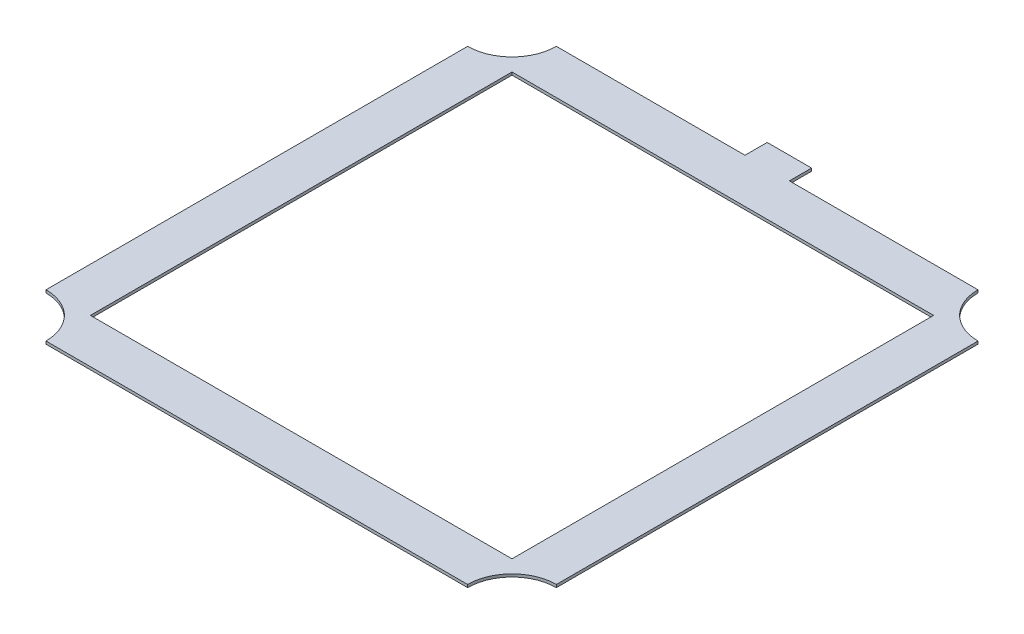
ISO-10303-21;
HEADER;
FILE_DESCRIPTION(('STEP AP214'),'2;1');
FILE_NAME('part.step','',(''),(''),'','','');
FILE_SCHEMA(('AUTOMOTIVE_DESIGN { 1 0 10303 214 1 1 1 1 }'));
ENDSEC;
DATA;
#1=APPLICATION_CONTEXT('core data for automotive mechanical design processes');
#2=APPLICATION_PROTOCOL_DEFINITION('international standard','automotive_design',2000,#1);
#3=PRODUCT_CONTEXT('',#1,'mechanical');
#4=PRODUCT('Part','Part','',(#3));
#5=PRODUCT_RELATED_PRODUCT_CATEGORY('part','',(#4));
#6=PRODUCT_DEFINITION_FORMATION('','',#4);
#7=PRODUCT_DEFINITION_CONTEXT('part definition',#1,'design');
#8=PRODUCT_DEFINITION('design','',#6,#7);
#9=PRODUCT_DEFINITION_SHAPE('','',#8);
#10=(LENGTH_UNIT() NAMED_UNIT(*) SI_UNIT(.MILLI.,.METRE.));
#11=(NAMED_UNIT(*) PLANE_ANGLE_UNIT() SI_UNIT($,.RADIAN.));
#12=(NAMED_UNIT(*) SI_UNIT($,.STERADIAN.) SOLID_ANGLE_UNIT());
#13=UNCERTAINTY_MEASURE_WITH_UNIT(LENGTH_MEASURE(1.E-05),#10,'distance_accuracy_value','');
#14=(GEOMETRIC_REPRESENTATION_CONTEXT(3) GLOBAL_UNCERTAINTY_ASSIGNED_CONTEXT((#13)) GLOBAL_UNIT_ASSIGNED_CONTEXT((#10,
#11,#12)) REPRESENTATION_CONTEXT('',''));
#15=CARTESIAN_POINT('',(0.,0.,0.));
#16=DIRECTION('',(0.,0.,1.));
#17=DIRECTION('',(1.,0.,0.));
#18=AXIS2_PLACEMENT_3D('',#15,#16,#17);
#19=CARTESIAN_POINT('',(0.,0.8,-87.2860576490806));
#20=DIRECTION('',(0.,0.,-1.));
#21=DIRECTION('',(-1.,0.,0.));
#22=AXIS2_PLACEMENT_3D('',#19,#20,#21);
#23=PLANE('',#22);
#24=DIRECTION('',(1.,0.,0.));
#25=VECTOR('',#24,1.);
#26=CARTESIAN_POINT('',(0.,0.,-87.2860576490806));
#27=LINE('',#26,#25);
#28=CARTESIAN_POINT('',(15.8925337331762,0.,-87.2860576490806));
#29=VERTEX_POINT('',#28);
#30=CARTESIAN_POINT('',(69.8675337331762,0.,-87.2860576490806));
#31=VERTEX_POINT('',#30);
#32=EDGE_CURVE('E59',#29,#31,#27,.T.);
#33=ORIENTED_EDGE('',*,*,#32,.F.);
#34=DIRECTION('',(0.,1.,0.));
#35=VECTOR('',#34,1.);
#36=CARTESIAN_POINT('',(15.8925337331762,-14.1990316571237,-87.2860576490806));
#37=LINE('',#36,#35);
#38=CARTESIAN_POINT('',(15.8925337331762,0.8,-87.2860576490806));
#39=VERTEX_POINT('',#38);
#40=EDGE_CURVE('E54',#29,#39,#37,.T.);
#41=ORIENTED_EDGE('',*,*,#40,.T.);
#42=DIRECTION('',(1.,0.,0.));
#43=VECTOR('',#42,1.);
#44=CARTESIAN_POINT('',(0.,0.8,-87.2860576490806));
#45=LINE('',#44,#43);
#46=CARTESIAN_POINT('',(69.8675337331762,0.8,-87.2860576490806));
#47=VERTEX_POINT('',#46);
#48=EDGE_CURVE('E162',#39,#47,#45,.T.);
#49=ORIENTED_EDGE('',*,*,#48,.T.);
#50=DIRECTION('',(0.,-1.,0.));
#51=VECTOR('',#50,1.);
#52=CARTESIAN_POINT('',(69.8675337331762,0.8,-87.2860576490806));
#53=LINE('',#52,#51);
#54=EDGE_CURVE('E261',#47,#31,#53,.T.);
#55=ORIENTED_EDGE('',*,*,#54,.T.);
#56=EDGE_LOOP('',(#33,#41,#49,#55));
#57=FACE_BOUND('',#56,.T.);
#58=ADVANCED_FACE('F37',(#57),#23,.T.);
#59=CARTESIAN_POINT('',(0.,0.8,58.7639423509194));
#60=DIRECTION('',(0.,0.,-1.));
#61=DIRECTION('',(-1.,0.,0.));
#62=AXIS2_PLACEMENT_3D('',#59,#60,#61);
#63=PLANE('',#62);
#64=DIRECTION('',(1.,0.,0.));
#65=VECTOR('',#64,1.);
#66=CARTESIAN_POINT('',(0.,0.,58.7639423509194));
#67=LINE('',#66,#65);
#68=CARTESIAN_POINT('',(-50.7824662668238,0.,58.7639423509194));
#69=VERTEX_POINT('',#68);
#70=CARTESIAN_POINT('',(69.8675337331762,0.,58.7639423509194));
#71=VERTEX_POINT('',#70);
#72=EDGE_CURVE('E232',#69,#71,#67,.T.);
#73=ORIENTED_EDGE('',*,*,#72,.T.);
#74=DIRECTION('',(0.,-1.,0.));
#75=VECTOR('',#74,1.);
#76=CARTESIAN_POINT('',(69.8675337331762,0.8,58.7639423509194));
#77=LINE('',#76,#75);
#78=CARTESIAN_POINT('',(69.8675337331762,0.8,58.7639423509194));
#79=VERTEX_POINT('',#78);
#80=EDGE_CURVE('E11',#79,#71,#77,.T.);
#81=ORIENTED_EDGE('',*,*,#80,.F.);
#82=DIRECTION('',(1.,0.,0.));
#83=VECTOR('',#82,1.);
#84=CARTESIAN_POINT('',(0.,0.8,58.7639423509194));
#85=LINE('',#84,#83);
#86=CARTESIAN_POINT('',(-50.7824662668238,0.8,58.7639423509194));
#87=VERTEX_POINT('',#86);
#88=EDGE_CURVE('E203',#87,#79,#85,.T.);
#89=ORIENTED_EDGE('',*,*,#88,.F.);
#90=DIRECTION('',(0.,-1.,0.));
#91=VECTOR('',#90,1.);
#92=CARTESIAN_POINT('',(-50.7824662668238,0.8,58.7639423509194));
#93=LINE('',#92,#91);
#94=EDGE_CURVE('E254',#87,#69,#93,.T.);
#95=ORIENTED_EDGE('',*,*,#94,.T.);
#96=EDGE_LOOP('',(#73,#81,#89,#95));
#97=FACE_BOUND('',#96,.T.);
#98=ADVANCED_FACE('F297',(#97),#63,.F.);
#99=CARTESIAN_POINT('',(82.5675337331762,0.8,58.7639423509195));
#100=DIRECTION('',(0.,-1.,0.));
#101=DIRECTION('',(0.,0.,-1.));
#102=AXIS2_PLACEMENT_3D('',#99,#100,#101);
#103=CYLINDRICAL_SURFACE('',#102,12.7);
#104=CARTESIAN_POINT('',(82.5675337331762,0.,58.7639423509195));
#105=DIRECTION('',(0.,1.,0.));
#106=DIRECTION('',(0.,0.,1.));
#107=AXIS2_PLACEMENT_3D('',#104,#105,#106);
#108=CIRCLE('',#107,12.7);
#109=CARTESIAN_POINT('',(82.5675337331762,0.,46.0639423509194));
#110=VERTEX_POINT('',#109);
#111=EDGE_CURVE('E235',#71,#110,#108,.F.);
#112=ORIENTED_EDGE('',*,*,#111,.T.);
#113=DIRECTION('',(0.,-1.,0.));
#114=VECTOR('',#113,1.);
#115=CARTESIAN_POINT('',(82.5675337331762,0.8,46.0639423509194));
#116=LINE('',#115,#114);
#117=CARTESIAN_POINT('',(82.5675337331762,0.8,46.0639423509194));
#118=VERTEX_POINT('',#117);
#119=EDGE_CURVE('E46',#118,#110,#116,.T.);
#120=ORIENTED_EDGE('',*,*,#119,.F.);
#121=CARTESIAN_POINT('',(82.5675337331762,0.8,58.7639423509195));
#122=DIRECTION('',(0.,1.,0.));
#123=DIRECTION('',(0.,0.,1.));
#124=AXIS2_PLACEMENT_3D('',#121,#122,#123);
#125=CIRCLE('',#124,12.7);
#126=EDGE_CURVE('E205',#79,#118,#125,.F.);
#127=ORIENTED_EDGE('',*,*,#126,.F.);
#128=ORIENTED_EDGE('',*,*,#80,.T.);
#129=EDGE_LOOP('',(#112,#120,#127,#128));
#130=FACE_BOUND('',#129,.T.);
#131=ADVANCED_FACE('F304',(#130),#103,.F.);
#132=CARTESIAN_POINT('',(82.5675337331762,0.8,0.));
#133=DIRECTION('',(1.,0.,0.));
#134=DIRECTION('',(0.,0.,-1.));
#135=AXIS2_PLACEMENT_3D('',#132,#133,#134);
#136=PLANE('',#135);
#137=DIRECTION('',(0.,0.,1.));
#138=VECTOR('',#137,1.);
#139=CARTESIAN_POINT('',(82.5675337331762,0.,0.));
#140=LINE('',#139,#138);
#141=CARTESIAN_POINT('',(82.5675337331762,0.,-74.5860576490806));
#142=VERTEX_POINT('',#141);
#143=EDGE_CURVE('E238',#142,#110,#140,.T.);
#144=ORIENTED_EDGE('',*,*,#143,.F.);
#145=DIRECTION('',(0.,-1.,0.));
#146=VECTOR('',#145,1.);
#147=CARTESIAN_POINT('',(82.5675337331762,0.8,-74.5860576490806));
#148=LINE('',#147,#146);
#149=CARTESIAN_POINT('',(82.5675337331762,0.8,-74.5860576490806));
#150=VERTEX_POINT('',#149);
#151=EDGE_CURVE('E263',#150,#142,#148,.T.);
#152=ORIENTED_EDGE('',*,*,#151,.F.);
#153=DIRECTION('',(0.,0.,1.));
#154=VECTOR('',#153,1.);
#155=CARTESIAN_POINT('',(82.5675337331762,0.8,0.));
#156=LINE('',#155,#154);
#157=EDGE_CURVE('E207',#150,#118,#156,.T.);
#158=ORIENTED_EDGE('',*,*,#157,.T.);
#159=ORIENTED_EDGE('',*,*,#119,.T.);
#160=EDGE_LOOP('',(#144,#152,#158,#159));
#161=FACE_BOUND('',#160,.T.);
#162=ADVANCED_FACE('F318',(#161),#136,.T.);
#163=CARTESIAN_POINT('',(82.5675337331762,0.8,-87.2860576490806));
#164=DIRECTION('',(0.,-1.,0.));
#165=DIRECTION('',(0.,0.,-1.));
#166=AXIS2_PLACEMENT_3D('',#163,#164,#165);
#167=CYLINDRICAL_SURFACE('',#166,12.7);
#168=CARTESIAN_POINT('',(82.5675337331762,0.,-87.2860576490806));
#169=DIRECTION('',(0.,1.,0.));
#170=DIRECTION('',(0.,0.,1.));
#171=AXIS2_PLACEMENT_3D('',#168,#169,#170);
#172=CIRCLE('',#171,12.7);
#173=EDGE_CURVE('E241',#31,#142,#172,.T.);
#174=ORIENTED_EDGE('',*,*,#173,.F.);
#175=ORIENTED_EDGE('',*,*,#54,.F.);
#176=CARTESIAN_POINT('',(82.5675337331762,0.8,-87.2860576490806));
#177=DIRECTION('',(0.,1.,0.));
#178=DIRECTION('',(0.,0.,1.));
#179=AXIS2_PLACEMENT_3D('',#176,#177,#178);
#180=CIRCLE('',#179,12.7);
#181=EDGE_CURVE('E210',#47,#150,#180,.T.);
#182=ORIENTED_EDGE('',*,*,#181,.T.);
#183=ORIENTED_EDGE('',*,*,#151,.T.);
#184=EDGE_LOOP('',(#174,#175,#182,#183));
#185=FACE_BOUND('',#184,.T.);
#186=ADVANCED_FACE('F310',(#185),#167,.F.);
#187=DIRECTION('',(0.,1.,0.));
#188=VECTOR('',#187,1.);
#189=CARTESIAN_POINT('',(3.19253373317623,-14.1990316571237,-87.2860576490806));
#190=LINE('',#189,#188);
#191=CARTESIAN_POINT('',(3.19253373317623,0.,-87.2860576490806));
#192=VERTEX_POINT('',#191);
#193=CARTESIAN_POINT('',(3.19253373317623,0.8,-87.2860576490806));
#194=VERTEX_POINT('',#193);
#195=EDGE_CURVE('E154',#192,#194,#190,.T.);
#196=ORIENTED_EDGE('',*,*,#195,.F.);
#197=CARTESIAN_POINT('',(-50.7824662668238,0.,-87.2860576490806));
#198=VERTEX_POINT('',#197);
#199=EDGE_CURVE('E244',#198,#192,#27,.T.);
#200=ORIENTED_EDGE('',*,*,#199,.F.);
#201=DIRECTION('',(0.,-1.,0.));
#202=VECTOR('',#201,1.);
#203=CARTESIAN_POINT('',(-50.7824662668238,0.8,-87.2860576490806));
#204=LINE('',#203,#202);
#205=CARTESIAN_POINT('',(-50.7824662668238,0.8,-87.2860576490806));
#206=VERTEX_POINT('',#205);
#207=EDGE_CURVE('E156',#206,#198,#204,.T.);
#208=ORIENTED_EDGE('',*,*,#207,.F.);
#209=EDGE_CURVE('E150',#206,#194,#45,.T.);
#210=ORIENTED_EDGE('',*,*,#209,.T.);
#211=EDGE_LOOP('',(#196,#200,#208,#210));
#212=FACE_BOUND('',#211,.T.);
#213=ADVANCED_FACE('F152',(#212),#23,.T.);
#214=CARTESIAN_POINT('',(-63.4824662668238,0.8,-87.2860576490806));
#215=DIRECTION('',(0.,-1.,0.));
#216=DIRECTION('',(0.,0.,-1.));
#217=AXIS2_PLACEMENT_3D('',#214,#215,#216);
#218=CYLINDRICAL_SURFACE('',#217,12.7);
#219=CARTESIAN_POINT('',(-63.4824662668238,0.,-87.2860576490806));
#220=DIRECTION('',(0.,1.,0.));
#221=DIRECTION('',(0.,0.,1.));
#222=AXIS2_PLACEMENT_3D('',#219,#220,#221);
#223=CIRCLE('',#222,12.7);
#224=CARTESIAN_POINT('',(-63.4824662668237,0.,-74.5860576490806));
#225=VERTEX_POINT('',#224);
#226=EDGE_CURVE('E246',#225,#198,#223,.T.);
#227=ORIENTED_EDGE('',*,*,#226,.F.);
#228=DIRECTION('',(0.,-1.,0.));
#229=VECTOR('',#228,1.);
#230=CARTESIAN_POINT('',(-63.4824662668237,0.8,-74.5860576490806));
#231=LINE('',#230,#229);
#232=CARTESIAN_POINT('',(-63.4824662668237,0.8,-74.5860576490806));
#233=VERTEX_POINT('',#232);
#234=EDGE_CURVE('E258',#233,#225,#231,.T.);
#235=ORIENTED_EDGE('',*,*,#234,.F.);
#236=CARTESIAN_POINT('',(-63.4824662668238,0.8,-87.2860576490806));
#237=DIRECTION('',(0.,1.,0.));
#238=DIRECTION('',(0.,0.,1.));
#239=AXIS2_PLACEMENT_3D('',#236,#237,#238);
#240=CIRCLE('',#239,12.7);
#241=EDGE_CURVE('E161',#233,#206,#240,.T.);
#242=ORIENTED_EDGE('',*,*,#241,.T.);
#243=ORIENTED_EDGE('',*,*,#207,.T.);
#244=EDGE_LOOP('',(#227,#235,#242,#243));
#245=FACE_BOUND('',#244,.T.);
#246=ADVANCED_FACE('F309',(#245),#218,.F.);
#247=CARTESIAN_POINT('',(-63.4824662668237,0.8,0.));
#248=DIRECTION('',(1.,0.,0.));
#249=DIRECTION('',(0.,0.,-1.));
#250=AXIS2_PLACEMENT_3D('',#247,#248,#249);
#251=PLANE('',#250);
#252=DIRECTION('',(0.,0.,1.));
#253=VECTOR('',#252,1.);
#254=CARTESIAN_POINT('',(-63.4824662668237,0.,0.));
#255=LINE('',#254,#253);
#256=CARTESIAN_POINT('',(-63.4824662668237,0.,46.0639423509194));
#257=VERTEX_POINT('',#256);
#258=EDGE_CURVE('E249',#225,#257,#255,.T.);
#259=ORIENTED_EDGE('',*,*,#258,.T.);
#260=DIRECTION('',(0.,-1.,0.));
#261=VECTOR('',#260,1.);
#262=CARTESIAN_POINT('',(-63.4824662668237,0.8,46.0639423509194));
#263=LINE('',#262,#261);
#264=CARTESIAN_POINT('',(-63.4824662668237,0.8,46.0639423509194));
#265=VERTEX_POINT('',#264);
#266=EDGE_CURVE('E256',#265,#257,#263,.T.);
#267=ORIENTED_EDGE('',*,*,#266,.F.);
#268=DIRECTION('',(0.,0.,1.));
#269=VECTOR('',#268,1.);
#270=CARTESIAN_POINT('',(-63.4824662668237,0.8,0.));
#271=LINE('',#270,#269);
#272=EDGE_CURVE('E214',#233,#265,#271,.T.);
#273=ORIENTED_EDGE('',*,*,#272,.F.);
#274=ORIENTED_EDGE('',*,*,#234,.T.);
#275=EDGE_LOOP('',(#259,#267,#273,#274));
#276=FACE_BOUND('',#275,.T.);
#277=ADVANCED_FACE('F315',(#276),#251,.F.);
#278=CARTESIAN_POINT('',(0.,0.8,-74.5860576490806));
#279=DIRECTION('',(0.,0.,-1.));
#280=DIRECTION('',(-1.,0.,0.));
#281=AXIS2_PLACEMENT_3D('',#278,#279,#280);
#282=PLANE('',#281);
#283=DIRECTION('',(1.,0.,0.));
#284=VECTOR('',#283,1.);
#285=CARTESIAN_POINT('',(0.,0.,-74.5860576490806));
#286=LINE('',#285,#284);
#287=CARTESIAN_POINT('',(-50.7824662668238,0.,-74.5860576490806));
#288=VERTEX_POINT('',#287);
#289=CARTESIAN_POINT('',(69.8675337331762,0.,-74.5860576490806));
#290=VERTEX_POINT('',#289);
#291=EDGE_CURVE('E220',#288,#290,#286,.T.);
#292=ORIENTED_EDGE('',*,*,#291,.T.);
#293=DIRECTION('',(0.,-1.,0.));
#294=VECTOR('',#293,1.);
#295=CARTESIAN_POINT('',(69.8675337331762,0.8,-74.5860576490806));
#296=LINE('',#295,#294);
#297=CARTESIAN_POINT('',(69.8675337331762,0.8,-74.5860576490806));
#298=VERTEX_POINT('',#297);
#299=EDGE_CURVE('E41',#298,#290,#296,.T.);
#300=ORIENTED_EDGE('',*,*,#299,.F.);
#301=DIRECTION('',(1.,0.,0.));
#302=VECTOR('',#301,1.);
#303=CARTESIAN_POINT('',(0.,0.8,-74.5860576490806));
#304=LINE('',#303,#302);
#305=CARTESIAN_POINT('',(-50.7824662668238,0.8,-74.5860576490806));
#306=VERTEX_POINT('',#305);
#307=EDGE_CURVE('E191',#306,#298,#304,.T.);
#308=ORIENTED_EDGE('',*,*,#307,.F.);
#309=DIRECTION('',(0.,-1.,0.));
#310=VECTOR('',#309,1.);
#311=CARTESIAN_POINT('',(-50.7824662668238,0.8,-74.5860576490806));
#312=LINE('',#311,#310);
#313=EDGE_CURVE('E219',#306,#288,#312,.T.);
#314=ORIENTED_EDGE('',*,*,#313,.T.);
#315=EDGE_LOOP('',(#292,#300,#308,#314));
#316=FACE_BOUND('',#315,.T.);
#317=ADVANCED_FACE('F39',(#316),#282,.F.);
#318=CARTESIAN_POINT('',(69.8675337331762,0.8,0.));
#319=DIRECTION('',(1.,0.,0.));
#320=DIRECTION('',(0.,0.,-1.));
#321=AXIS2_PLACEMENT_3D('',#318,#319,#320);
#322=PLANE('',#321);
#323=DIRECTION('',(0.,0.,1.));
#324=VECTOR('',#323,1.);
#325=CARTESIAN_POINT('',(69.8675337331762,0.,0.));
#326=LINE('',#325,#324);
#327=CARTESIAN_POINT('',(69.8675337331762,0.,46.0639423509194));
#328=VERTEX_POINT('',#327);
#329=EDGE_CURVE('E223',#290,#328,#326,.T.);
#330=ORIENTED_EDGE('',*,*,#329,.T.);
#331=DIRECTION('',(0.,-1.,0.));
#332=VECTOR('',#331,1.);
#333=CARTESIAN_POINT('',(69.8675337331762,0.8,46.0639423509194));
#334=LINE('',#333,#332);
#335=CARTESIAN_POINT('',(69.8675337331762,0.8,46.0639423509194));
#336=VERTEX_POINT('',#335);
#337=EDGE_CURVE('E268',#336,#328,#334,.T.);
#338=ORIENTED_EDGE('',*,*,#337,.F.);
#339=DIRECTION('',(0.,0.,1.));
#340=VECTOR('',#339,1.);
#341=CARTESIAN_POINT('',(69.8675337331762,0.8,0.));
#342=LINE('',#341,#340);
#343=EDGE_CURVE('E194',#298,#336,#342,.T.);
#344=ORIENTED_EDGE('',*,*,#343,.F.);
#345=ORIENTED_EDGE('',*,*,#299,.T.);
#346=EDGE_LOOP('',(#330,#338,#344,#345));
#347=FACE_BOUND('',#346,.T.);
#348=ADVANCED_FACE('F275',(#347),#322,.F.);
#349=CARTESIAN_POINT('',(0.,0.8,46.0639423509194));
#350=DIRECTION('',(0.,0.,-1.));
#351=DIRECTION('',(-1.,0.,0.));
#352=AXIS2_PLACEMENT_3D('',#349,#350,#351);
#353=PLANE('',#352);
#354=DIRECTION('',(1.,0.,0.));
#355=VECTOR('',#354,1.);
#356=CARTESIAN_POINT('',(0.,0.,46.0639423509194));
#357=LINE('',#356,#355);
#358=CARTESIAN_POINT('',(-50.7824662668238,0.,46.0639423509194));
#359=VERTEX_POINT('',#358);
#360=EDGE_CURVE('E226',#359,#328,#357,.T.);
#361=ORIENTED_EDGE('',*,*,#360,.F.);
#362=DIRECTION('',(0.,-1.,0.));
#363=VECTOR('',#362,1.);
#364=CARTESIAN_POINT('',(-50.7824662668238,0.8,46.0639423509194));
#365=LINE('',#364,#363);
#366=CARTESIAN_POINT('',(-50.7824662668238,0.8,46.0639423509194));
#367=VERTEX_POINT('',#366);
#368=EDGE_CURVE('E267',#367,#359,#365,.T.);
#369=ORIENTED_EDGE('',*,*,#368,.F.);
#370=DIRECTION('',(1.,0.,0.));
#371=VECTOR('',#370,1.);
#372=CARTESIAN_POINT('',(0.,0.8,46.0639423509194));
#373=LINE('',#372,#371);
#374=EDGE_CURVE('E197',#367,#336,#373,.T.);
#375=ORIENTED_EDGE('',*,*,#374,.T.);
#376=ORIENTED_EDGE('',*,*,#337,.T.);
#377=EDGE_LOOP('',(#361,#369,#375,#376));
#378=FACE_BOUND('',#377,.T.);
#379=ADVANCED_FACE('F287',(#378),#353,.T.);
#380=CARTESIAN_POINT('',(-50.7824662668238,0.8,0.));
#381=DIRECTION('',(1.,0.,0.));
#382=DIRECTION('',(0.,0.,-1.));
#383=AXIS2_PLACEMENT_3D('',#380,#381,#382);
#384=PLANE('',#383);
#385=DIRECTION('',(0.,0.,1.));
#386=VECTOR('',#385,1.);
#387=CARTESIAN_POINT('',(-50.7824662668238,0.,0.));
#388=LINE('',#387,#386);
#389=EDGE_CURVE('E229',#288,#359,#388,.T.);
#390=ORIENTED_EDGE('',*,*,#389,.F.);
#391=ORIENTED_EDGE('',*,*,#313,.F.);
#392=DIRECTION('',(0.,0.,1.));
#393=VECTOR('',#392,1.);
#394=CARTESIAN_POINT('',(-50.7824662668238,0.8,0.));
#395=LINE('',#394,#393);
#396=EDGE_CURVE('E200',#306,#367,#395,.T.);
#397=ORIENTED_EDGE('',*,*,#396,.T.);
#398=ORIENTED_EDGE('',*,*,#368,.T.);
#399=EDGE_LOOP('',(#390,#391,#397,#398));
#400=FACE_BOUND('',#399,.T.);
#401=ADVANCED_FACE('F284',(#400),#384,.T.);
#402=CARTESIAN_POINT('',(-63.4824662668238,0.8,58.7639423509195));
#403=DIRECTION('',(0.,-1.,0.));
#404=DIRECTION('',(0.,0.,-1.));
#405=AXIS2_PLACEMENT_3D('',#402,#403,#404);
#406=CYLINDRICAL_SURFACE('',#405,12.7);
#407=CARTESIAN_POINT('',(-63.4824662668238,0.,58.7639423509195));
#408=DIRECTION('',(0.,1.,0.));
#409=DIRECTION('',(0.,0.,1.));
#410=AXIS2_PLACEMENT_3D('',#407,#408,#409);
#411=CIRCLE('',#410,12.7);
#412=EDGE_CURVE('E195',#69,#257,#411,.T.);
#413=ORIENTED_EDGE('',*,*,#412,.F.);
#414=ORIENTED_EDGE('',*,*,#94,.F.);
#415=CARTESIAN_POINT('',(-63.4824662668238,0.8,58.7639423509195));
#416=DIRECTION('',(0.,1.,0.));
#417=DIRECTION('',(0.,0.,1.));
#418=AXIS2_PLACEMENT_3D('',#415,#416,#417);
#419=CIRCLE('',#418,12.7);
#420=EDGE_CURVE('E216',#87,#265,#419,.T.);
#421=ORIENTED_EDGE('',*,*,#420,.T.);
#422=ORIENTED_EDGE('',*,*,#266,.T.);
#423=EDGE_LOOP('',(#413,#414,#421,#422));
#424=FACE_BOUND('',#423,.T.);
#425=ADVANCED_FACE('F294',(#424),#406,.F.);
#426=CARTESIAN_POINT('',(0.,0.8,0.));
#427=DIRECTION('',(0.,1.,0.));
#428=DIRECTION('',(0.,0.,1.));
#429=AXIS2_PLACEMENT_3D('',#426,#427,#428);
#430=PLANE('',#429);
#431=ORIENTED_EDGE('',*,*,#307,.T.);
#432=ORIENTED_EDGE('',*,*,#343,.T.);
#433=ORIENTED_EDGE('',*,*,#374,.F.);
#434=ORIENTED_EDGE('',*,*,#396,.F.);
#435=EDGE_LOOP('',(#431,#432,#433,#434));
#436=FACE_BOUND('',#435,.T.);
#437=ORIENTED_EDGE('',*,*,#88,.T.);
#438=ORIENTED_EDGE('',*,*,#126,.T.);
#439=ORIENTED_EDGE('',*,*,#157,.F.);
#440=ORIENTED_EDGE('',*,*,#181,.F.);
#441=ORIENTED_EDGE('',*,*,#48,.F.);
#442=DIRECTION('',(0.,0.,-1.));
#443=VECTOR('',#442,1.);
#444=CARTESIAN_POINT('',(15.8925337331762,0.8,-87.2860576490806));
#445=LINE('',#444,#443);
#446=CARTESIAN_POINT('',(15.8925337331762,0.8,-93.6360576490806));
#447=VERTEX_POINT('',#446);
#448=EDGE_CURVE('E178',#39,#447,#445,.T.);
#449=ORIENTED_EDGE('',*,*,#448,.T.);
#450=DIRECTION('',(-1.,0.,0.));
#451=VECTOR('',#450,1.);
#452=CARTESIAN_POINT('',(3.19253373317623,0.8,-93.6360576490806));
#453=LINE('',#452,#451);
#454=CARTESIAN_POINT('',(3.19253373317623,0.8,-93.6360576490806));
#455=VERTEX_POINT('',#454);
#456=EDGE_CURVE('E172',#447,#455,#453,.T.);
#457=ORIENTED_EDGE('',*,*,#456,.T.);
#458=DIRECTION('',(0.,0.,1.));
#459=VECTOR('',#458,1.);
#460=CARTESIAN_POINT('',(3.19253373317623,0.8,-87.2860576490806));
#461=LINE('',#460,#459);
#462=EDGE_CURVE('E169',#455,#194,#461,.T.);
#463=ORIENTED_EDGE('',*,*,#462,.T.);
#464=ORIENTED_EDGE('',*,*,#209,.F.);
#465=ORIENTED_EDGE('',*,*,#241,.F.);
#466=ORIENTED_EDGE('',*,*,#272,.T.);
#467=ORIENTED_EDGE('',*,*,#420,.F.);
#468=EDGE_LOOP('',(#437,#438,#439,#440,#441,#449,#457,#463,#464,#465,#466,#467));
#469=FACE_BOUND('',#468,.T.);
#470=ADVANCED_FACE('F175',(#436,#469),#430,.T.);
#471=CARTESIAN_POINT('',(0.,0.,0.));
#472=DIRECTION('',(0.,1.,0.));
#473=DIRECTION('',(0.,0.,1.));
#474=AXIS2_PLACEMENT_3D('',#471,#472,#473);
#475=PLANE('',#474);
#476=ORIENTED_EDGE('',*,*,#291,.F.);
#477=ORIENTED_EDGE('',*,*,#389,.T.);
#478=ORIENTED_EDGE('',*,*,#360,.T.);
#479=ORIENTED_EDGE('',*,*,#329,.F.);
#480=EDGE_LOOP('',(#476,#477,#478,#479));
#481=FACE_BOUND('',#480,.T.);
#482=ORIENTED_EDGE('',*,*,#72,.F.);
#483=ORIENTED_EDGE('',*,*,#412,.T.);
#484=ORIENTED_EDGE('',*,*,#258,.F.);
#485=ORIENTED_EDGE('',*,*,#226,.T.);
#486=ORIENTED_EDGE('',*,*,#199,.T.);
#487=DIRECTION('',(0.,0.,-1.));
#488=VECTOR('',#487,1.);
#489=CARTESIAN_POINT('',(3.19253373317623,0.,-87.2860576490806));
#490=LINE('',#489,#488);
#491=CARTESIAN_POINT('',(3.19253373317623,0.,-93.6360576490806));
#492=VERTEX_POINT('',#491);
#493=EDGE_CURVE('E171',#192,#492,#490,.T.);
#494=ORIENTED_EDGE('',*,*,#493,.T.);
#495=DIRECTION('',(1.,0.,0.));
#496=VECTOR('',#495,1.);
#497=CARTESIAN_POINT('',(3.19253373317623,0.,-93.6360576490806));
#498=LINE('',#497,#496);
#499=CARTESIAN_POINT('',(15.8925337331762,0.,-93.6360576490806));
#500=VERTEX_POINT('',#499);
#501=EDGE_CURVE('E346',#492,#500,#498,.T.);
#502=ORIENTED_EDGE('',*,*,#501,.T.);
#503=DIRECTION('',(0.,0.,1.));
#504=VECTOR('',#503,1.);
#505=CARTESIAN_POINT('',(15.8925337331762,0.,-87.2860576490806));
#506=LINE('',#505,#504);
#507=EDGE_CURVE('E187',#500,#29,#506,.T.);
#508=ORIENTED_EDGE('',*,*,#507,.T.);
#509=ORIENTED_EDGE('',*,*,#32,.T.);
#510=ORIENTED_EDGE('',*,*,#173,.T.);
#511=ORIENTED_EDGE('',*,*,#143,.T.);
#512=ORIENTED_EDGE('',*,*,#111,.F.);
#513=EDGE_LOOP('',(#482,#483,#484,#485,#486,#494,#502,#508,#509,#510,#511,#512));
#514=FACE_BOUND('',#513,.T.);
#515=ADVANCED_FACE('F281',(#481,#514),#475,.F.);
#516=CARTESIAN_POINT('',(3.19253373317623,-14.1990316571237,-87.2860576490806));
#517=DIRECTION('',(-1.,0.,0.));
#518=DIRECTION('',(0.,0.,1.));
#519=AXIS2_PLACEMENT_3D('',#516,#517,#518);
#520=PLANE('',#519);
#521=ORIENTED_EDGE('',*,*,#493,.F.);
#522=ORIENTED_EDGE('',*,*,#195,.T.);
#523=ORIENTED_EDGE('',*,*,#462,.F.);
#524=DIRECTION('',(0.,1.,0.));
#525=VECTOR('',#524,1.);
#526=CARTESIAN_POINT('',(3.19253373317623,-14.1990316571237,-93.6360576490806));
#527=LINE('',#526,#525);
#528=EDGE_CURVE('E185',#492,#455,#527,.T.);
#529=ORIENTED_EDGE('',*,*,#528,.F.);
#530=EDGE_LOOP('',(#521,#522,#523,#529));
#531=FACE_BOUND('',#530,.T.);
#532=ADVANCED_FACE('F167',(#531),#520,.T.);
#533=CARTESIAN_POINT('',(3.19253373317623,-14.1990316571237,-93.6360576490806));
#534=DIRECTION('',(0.,0.,-1.));
#535=DIRECTION('',(-1.,0.,0.));
#536=AXIS2_PLACEMENT_3D('',#533,#534,#535);
#537=PLANE('',#536);
#538=ORIENTED_EDGE('',*,*,#501,.F.);
#539=ORIENTED_EDGE('',*,*,#528,.T.);
#540=ORIENTED_EDGE('',*,*,#456,.F.);
#541=DIRECTION('',(0.,1.,0.));
#542=VECTOR('',#541,1.);
#543=CARTESIAN_POINT('',(15.8925337331762,-14.1990316571237,-93.6360576490806));
#544=LINE('',#543,#542);
#545=EDGE_CURVE('E188',#500,#447,#544,.T.);
#546=ORIENTED_EDGE('',*,*,#545,.F.);
#547=EDGE_LOOP('',(#538,#539,#540,#546));
#548=FACE_BOUND('',#547,.T.);
#549=ADVANCED_FACE('F345',(#548),#537,.T.);
#550=CARTESIAN_POINT('',(15.8925337331762,-14.1990316571237,-87.2860576490806));
#551=DIRECTION('',(1.,0.,0.));
#552=DIRECTION('',(0.,0.,-1.));
#553=AXIS2_PLACEMENT_3D('',#550,#551,#552);
#554=PLANE('',#553);
#555=ORIENTED_EDGE('',*,*,#507,.F.);
#556=ORIENTED_EDGE('',*,*,#545,.T.);
#557=ORIENTED_EDGE('',*,*,#448,.F.);
#558=ORIENTED_EDGE('',*,*,#40,.F.);
#559=EDGE_LOOP('',(#555,#556,#557,#558));
#560=FACE_BOUND('',#559,.T.);
#561=ADVANCED_FACE('F341',(#560),#554,.T.);
#562=CLOSED_SHELL('',(#58,#98,#131,#162,#186,#213,#246,#277,#317,#348,#379,#401,#425,#470,#515,
#532,#549,#561));
#563=MANIFOLD_SOLID_BREP('B2',#562);
#564=ADVANCED_BREP_SHAPE_REPRESENTATION('',(#18,#563),#14);
#565=SHAPE_DEFINITION_REPRESENTATION(#9,#564);
ENDSEC;
END-ISO-10303-21;
